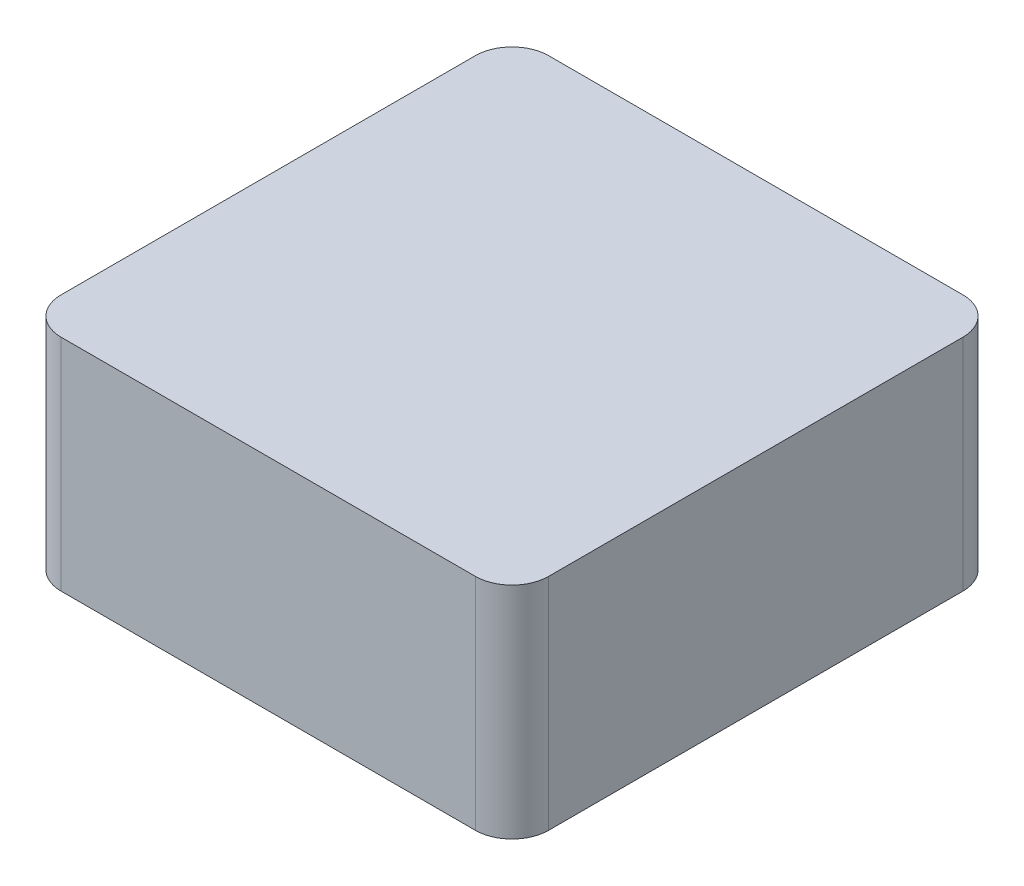
ISO-10303-21;
HEADER;
FILE_DESCRIPTION(('STEP AP214'),'2;1');
FILE_NAME('part.step','',(''),(''),'','','');
FILE_SCHEMA(('AUTOMOTIVE_DESIGN { 1 0 10303 214 1 1 1 1 }'));
ENDSEC;
DATA;
#1=APPLICATION_CONTEXT('core data for automotive mechanical design processes');
#2=APPLICATION_PROTOCOL_DEFINITION('international standard','automotive_design',2000,#1);
#3=PRODUCT_CONTEXT('',#1,'mechanical');
#4=PRODUCT('Part','Part','',(#3));
#5=PRODUCT_RELATED_PRODUCT_CATEGORY('part','',(#4));
#6=PRODUCT_DEFINITION_FORMATION('','',#4);
#7=PRODUCT_DEFINITION_CONTEXT('part definition',#1,'design');
#8=PRODUCT_DEFINITION('design','',#6,#7);
#9=PRODUCT_DEFINITION_SHAPE('','',#8);
#10=(LENGTH_UNIT() NAMED_UNIT(*) SI_UNIT(.MILLI.,.METRE.));
#11=(NAMED_UNIT(*) PLANE_ANGLE_UNIT() SI_UNIT($,.RADIAN.));
#12=(NAMED_UNIT(*) SI_UNIT($,.STERADIAN.) SOLID_ANGLE_UNIT());
#13=UNCERTAINTY_MEASURE_WITH_UNIT(LENGTH_MEASURE(1.E-05),#10,'distance_accuracy_value','');
#14=(GEOMETRIC_REPRESENTATION_CONTEXT(3) GLOBAL_UNCERTAINTY_ASSIGNED_CONTEXT((#13)) GLOBAL_UNIT_ASSIGNED_CONTEXT((#10,
#11,#12)) REPRESENTATION_CONTEXT('',''));
#15=CARTESIAN_POINT('',(0.,0.,0.));
#16=DIRECTION('',(0.,0.,1.));
#17=DIRECTION('',(1.,0.,0.));
#18=AXIS2_PLACEMENT_3D('',#15,#16,#17);
#19=CARTESIAN_POINT('',(3.325,3.,3.325));
#20=DIRECTION('',(-1.,0.,0.));
#21=DIRECTION('',(0.,0.,1.));
#22=AXIS2_PLACEMENT_3D('',#19,#20,#21);
#23=PLANE('',#22);
#24=DIRECTION('',(0.,0.,-1.));
#25=VECTOR('',#24,1.);
#26=CARTESIAN_POINT('',(3.325,0.,3.325));
#27=LINE('',#26,#25);
#28=CARTESIAN_POINT('',(3.325,0.,2.825));
#29=VERTEX_POINT('',#28);
#30=CARTESIAN_POINT('',(3.325,0.,-2.825));
#31=VERTEX_POINT('',#30);
#32=EDGE_CURVE('E138',#29,#31,#27,.T.);
#33=ORIENTED_EDGE('',*,*,#32,.T.);
#34=DIRECTION('',(0.,-1.,0.));
#35=VECTOR('',#34,1.);
#36=CARTESIAN_POINT('',(3.325,3.,-2.825));
#37=LINE('',#36,#35);
#38=CARTESIAN_POINT('',(3.325,3.,-2.825));
#39=VERTEX_POINT('',#38);
#40=EDGE_CURVE('E113',#31,#39,#37,.F.);
#41=ORIENTED_EDGE('',*,*,#40,.T.);
#42=DIRECTION('',(0.,0.,-1.));
#43=VECTOR('',#42,1.);
#44=CARTESIAN_POINT('',(3.325,3.,3.325));
#45=LINE('',#44,#43);
#46=CARTESIAN_POINT('',(3.325,3.,2.825));
#47=VERTEX_POINT('',#46);
#48=EDGE_CURVE('E150',#47,#39,#45,.T.);
#49=ORIENTED_EDGE('',*,*,#48,.F.);
#50=DIRECTION('',(0.,-1.,0.));
#51=VECTOR('',#50,1.);
#52=CARTESIAN_POINT('',(3.325,3.,2.825));
#53=LINE('',#52,#51);
#54=EDGE_CURVE('E119',#47,#29,#53,.T.);
#55=ORIENTED_EDGE('',*,*,#54,.T.);
#56=EDGE_LOOP('',(#33,#41,#49,#55));
#57=FACE_BOUND('',#56,.T.);
#58=ADVANCED_FACE('F41',(#57),#23,.F.);
#59=CARTESIAN_POINT('',(-3.325,3.,-3.325));
#60=DIRECTION('',(0.,0.,1.));
#61=DIRECTION('',(1.,0.,0.));
#62=AXIS2_PLACEMENT_3D('',#59,#60,#61);
#63=PLANE('',#62);
#64=DIRECTION('',(-1.,0.,0.));
#65=VECTOR('',#64,1.);
#66=CARTESIAN_POINT('',(-3.325,3.,-3.325));
#67=LINE('',#66,#65);
#68=CARTESIAN_POINT('',(2.825,3.,-3.325));
#69=VERTEX_POINT('',#68);
#70=CARTESIAN_POINT('',(-2.825,3.,-3.325));
#71=VERTEX_POINT('',#70);
#72=EDGE_CURVE('E129',#69,#71,#67,.T.);
#73=ORIENTED_EDGE('',*,*,#72,.F.);
#74=DIRECTION('',(0.,-1.,0.));
#75=VECTOR('',#74,1.);
#76=CARTESIAN_POINT('',(2.825,3.,-3.325));
#77=LINE('',#76,#75);
#78=CARTESIAN_POINT('',(2.825,0.,-3.325));
#79=VERTEX_POINT('',#78);
#80=EDGE_CURVE('E112',#69,#79,#77,.T.);
#81=ORIENTED_EDGE('',*,*,#80,.T.);
#82=DIRECTION('',(-1.,0.,0.));
#83=VECTOR('',#82,1.);
#84=CARTESIAN_POINT('',(-3.325,0.,-3.325));
#85=LINE('',#84,#83);
#86=CARTESIAN_POINT('',(-2.825,0.,-3.325));
#87=VERTEX_POINT('',#86);
#88=EDGE_CURVE('E126',#79,#87,#85,.T.);
#89=ORIENTED_EDGE('',*,*,#88,.T.);
#90=DIRECTION('',(0.,-1.,0.));
#91=VECTOR('',#90,1.);
#92=CARTESIAN_POINT('',(-2.825,3.,-3.325));
#93=LINE('',#92,#91);
#94=EDGE_CURVE('E132',#87,#71,#93,.F.);
#95=ORIENTED_EDGE('',*,*,#94,.T.);
#96=EDGE_LOOP('',(#73,#81,#89,#95));
#97=FACE_BOUND('',#96,.T.);
#98=ADVANCED_FACE('F125',(#97),#63,.F.);
#99=CARTESIAN_POINT('',(-3.325,3.,3.325));
#100=DIRECTION('',(1.,0.,0.));
#101=DIRECTION('',(0.,0.,-1.));
#102=AXIS2_PLACEMENT_3D('',#99,#100,#101);
#103=PLANE('',#102);
#104=DIRECTION('',(0.,0.,1.));
#105=VECTOR('',#104,1.);
#106=CARTESIAN_POINT('',(-3.325,3.,3.325));
#107=LINE('',#106,#105);
#108=CARTESIAN_POINT('',(-3.325,3.,-2.825));
#109=VERTEX_POINT('',#108);
#110=CARTESIAN_POINT('',(-3.325,3.,2.825));
#111=VERTEX_POINT('',#110);
#112=EDGE_CURVE('E186',#109,#111,#107,.T.);
#113=ORIENTED_EDGE('',*,*,#112,.F.);
#114=DIRECTION('',(0.,-1.,0.));
#115=VECTOR('',#114,1.);
#116=CARTESIAN_POINT('',(-3.325,3.,-2.825));
#117=LINE('',#116,#115);
#118=CARTESIAN_POINT('',(-3.325,0.,-2.825));
#119=VERTEX_POINT('',#118);
#120=EDGE_CURVE('E180',#109,#119,#117,.T.);
#121=ORIENTED_EDGE('',*,*,#120,.T.);
#122=DIRECTION('',(0.,0.,1.));
#123=VECTOR('',#122,1.);
#124=CARTESIAN_POINT('',(-3.325,0.,3.325));
#125=LINE('',#124,#123);
#126=CARTESIAN_POINT('',(-3.325,0.,2.825));
#127=VERTEX_POINT('',#126);
#128=EDGE_CURVE('E137',#119,#127,#125,.T.);
#129=ORIENTED_EDGE('',*,*,#128,.T.);
#130=DIRECTION('',(0.,-1.,0.));
#131=VECTOR('',#130,1.);
#132=CARTESIAN_POINT('',(-3.325,3.,2.825));
#133=LINE('',#132,#131);
#134=EDGE_CURVE('E177',#127,#111,#133,.F.);
#135=ORIENTED_EDGE('',*,*,#134,.T.);
#136=EDGE_LOOP('',(#113,#121,#129,#135));
#137=FACE_BOUND('',#136,.T.);
#138=ADVANCED_FACE('F207',(#137),#103,.F.);
#139=CARTESIAN_POINT('',(-3.325,3.,3.325));
#140=DIRECTION('',(0.,0.,-1.));
#141=DIRECTION('',(-1.,0.,0.));
#142=AXIS2_PLACEMENT_3D('',#139,#140,#141);
#143=PLANE('',#142);
#144=DIRECTION('',(1.,0.,0.));
#145=VECTOR('',#144,1.);
#146=CARTESIAN_POINT('',(-3.325,3.,3.325));
#147=LINE('',#146,#145);
#148=CARTESIAN_POINT('',(-2.825,3.,3.325));
#149=VERTEX_POINT('',#148);
#150=CARTESIAN_POINT('',(2.825,3.,3.325));
#151=VERTEX_POINT('',#150);
#152=EDGE_CURVE('E152',#149,#151,#147,.T.);
#153=ORIENTED_EDGE('',*,*,#152,.F.);
#154=DIRECTION('',(0.,-1.,0.));
#155=VECTOR('',#154,1.);
#156=CARTESIAN_POINT('',(-2.825,3.,3.325));
#157=LINE('',#156,#155);
#158=CARTESIAN_POINT('',(-2.825,0.,3.325));
#159=VERTEX_POINT('',#158);
#160=EDGE_CURVE('E11',#149,#159,#157,.T.);
#161=ORIENTED_EDGE('',*,*,#160,.T.);
#162=DIRECTION('',(1.,0.,0.));
#163=VECTOR('',#162,1.);
#164=CARTESIAN_POINT('',(-3.325,0.,3.325));
#165=LINE('',#164,#163);
#166=CARTESIAN_POINT('',(2.825,0.,3.325));
#167=VERTEX_POINT('',#166);
#168=EDGE_CURVE('E143',#159,#167,#165,.T.);
#169=ORIENTED_EDGE('',*,*,#168,.T.);
#170=DIRECTION('',(0.,-1.,0.));
#171=VECTOR('',#170,1.);
#172=CARTESIAN_POINT('',(2.825,3.,3.325));
#173=LINE('',#172,#171);
#174=EDGE_CURVE('E50',#167,#151,#173,.F.);
#175=ORIENTED_EDGE('',*,*,#174,.T.);
#176=EDGE_LOOP('',(#153,#161,#169,#175));
#177=FACE_BOUND('',#176,.T.);
#178=ADVANCED_FACE('F200',(#177),#143,.F.);
#179=CARTESIAN_POINT('',(0.,3.,0.));
#180=DIRECTION('',(0.,-1.,0.));
#181=DIRECTION('',(0.,0.,-1.));
#182=AXIS2_PLACEMENT_3D('',#179,#180,#181);
#183=PLANE('',#182);
#184=ORIENTED_EDGE('',*,*,#48,.T.);
#185=CARTESIAN_POINT('',(2.825,3.,-2.825));
#186=DIRECTION('',(0.,-1.,0.));
#187=DIRECTION('',(0.,0.,-1.));
#188=AXIS2_PLACEMENT_3D('',#185,#186,#187);
#189=CIRCLE('',#188,0.5);
#190=EDGE_CURVE('E174',#39,#69,#189,.F.);
#191=ORIENTED_EDGE('',*,*,#190,.T.);
#192=ORIENTED_EDGE('',*,*,#72,.T.);
#193=CARTESIAN_POINT('',(-2.825,3.,-2.825));
#194=DIRECTION('',(0.,-1.,0.));
#195=DIRECTION('',(0.,0.,-1.));
#196=AXIS2_PLACEMENT_3D('',#193,#194,#195);
#197=CIRCLE('',#196,0.5);
#198=EDGE_CURVE('E171',#71,#109,#197,.F.);
#199=ORIENTED_EDGE('',*,*,#198,.T.);
#200=ORIENTED_EDGE('',*,*,#112,.T.);
#201=CARTESIAN_POINT('',(-2.825,3.,2.825));
#202=DIRECTION('',(0.,-1.,0.));
#203=DIRECTION('',(0.,0.,-1.));
#204=AXIS2_PLACEMENT_3D('',#201,#202,#203);
#205=CIRCLE('',#204,0.5);
#206=EDGE_CURVE('E63',#111,#149,#205,.F.);
#207=ORIENTED_EDGE('',*,*,#206,.T.);
#208=ORIENTED_EDGE('',*,*,#152,.T.);
#209=CARTESIAN_POINT('',(2.825,3.,2.825));
#210=DIRECTION('',(0.,-1.,0.));
#211=DIRECTION('',(0.,0.,-1.));
#212=AXIS2_PLACEMENT_3D('',#209,#210,#211);
#213=CIRCLE('',#212,0.5);
#214=EDGE_CURVE('E166',#151,#47,#213,.F.);
#215=ORIENTED_EDGE('',*,*,#214,.T.);
#216=EDGE_LOOP('',(#184,#191,#192,#199,#200,#207,#208,#215));
#217=FACE_BOUND('',#216,.T.);
#218=ADVANCED_FACE('F194',(#217),#183,.F.);
#219=CARTESIAN_POINT('',(0.,0.,0.));
#220=DIRECTION('',(0.,-1.,0.));
#221=DIRECTION('',(0.,0.,-1.));
#222=AXIS2_PLACEMENT_3D('',#219,#220,#221);
#223=PLANE('',#222);
#224=ORIENTED_EDGE('',*,*,#88,.F.);
#225=CARTESIAN_POINT('',(2.825,0.,-2.825));
#226=DIRECTION('',(0.,-1.,0.));
#227=DIRECTION('',(0.,0.,-1.));
#228=AXIS2_PLACEMENT_3D('',#225,#226,#227);
#229=CIRCLE('',#228,0.5);
#230=EDGE_CURVE('E108',#79,#31,#229,.T.);
#231=ORIENTED_EDGE('',*,*,#230,.T.);
#232=ORIENTED_EDGE('',*,*,#32,.F.);
#233=CARTESIAN_POINT('',(2.825,0.,2.825));
#234=DIRECTION('',(0.,-1.,0.));
#235=DIRECTION('',(0.,0.,-1.));
#236=AXIS2_PLACEMENT_3D('',#233,#234,#235);
#237=CIRCLE('',#236,0.5);
#238=EDGE_CURVE('E131',#29,#167,#237,.T.);
#239=ORIENTED_EDGE('',*,*,#238,.T.);
#240=ORIENTED_EDGE('',*,*,#168,.F.);
#241=CARTESIAN_POINT('',(-2.825,0.,2.825));
#242=DIRECTION('',(0.,-1.,0.));
#243=DIRECTION('',(0.,0.,-1.));
#244=AXIS2_PLACEMENT_3D('',#241,#242,#243);
#245=CIRCLE('',#244,0.5);
#246=EDGE_CURVE('E156',#159,#127,#245,.T.);
#247=ORIENTED_EDGE('',*,*,#246,.T.);
#248=ORIENTED_EDGE('',*,*,#128,.F.);
#249=CARTESIAN_POINT('',(-2.825,0.,-2.825));
#250=DIRECTION('',(0.,-1.,0.));
#251=DIRECTION('',(0.,0.,-1.));
#252=AXIS2_PLACEMENT_3D('',#249,#250,#251);
#253=CIRCLE('',#252,0.5);
#254=EDGE_CURVE('E120',#119,#87,#253,.T.);
#255=ORIENTED_EDGE('',*,*,#254,.T.);
#256=EDGE_LOOP('',(#224,#231,#232,#239,#240,#247,#248,#255));
#257=FACE_BOUND('',#256,.T.);
#258=ADVANCED_FACE('F134',(#257),#223,.T.);
#259=CARTESIAN_POINT('',(2.825,3.,-2.825));
#260=DIRECTION('',(0.,-1.,0.));
#261=DIRECTION('',(0.,0.,-1.));
#262=AXIS2_PLACEMENT_3D('',#259,#260,#261);
#263=CYLINDRICAL_SURFACE('',#262,0.5);
#264=ORIENTED_EDGE('',*,*,#190,.F.);
#265=ORIENTED_EDGE('',*,*,#40,.F.);
#266=ORIENTED_EDGE('',*,*,#230,.F.);
#267=ORIENTED_EDGE('',*,*,#80,.F.);
#268=EDGE_LOOP('',(#264,#265,#266,#267));
#269=FACE_BOUND('',#268,.T.);
#270=ADVANCED_FACE('F111',(#269),#263,.T.);
#271=CARTESIAN_POINT('',(-2.825,3.,-2.825));
#272=DIRECTION('',(0.,-1.,0.));
#273=DIRECTION('',(0.,0.,-1.));
#274=AXIS2_PLACEMENT_3D('',#271,#272,#273);
#275=CYLINDRICAL_SURFACE('',#274,0.5);
#276=ORIENTED_EDGE('',*,*,#198,.F.);
#277=ORIENTED_EDGE('',*,*,#94,.F.);
#278=ORIENTED_EDGE('',*,*,#254,.F.);
#279=ORIENTED_EDGE('',*,*,#120,.F.);
#280=EDGE_LOOP('',(#276,#277,#278,#279));
#281=FACE_BOUND('',#280,.T.);
#282=ADVANCED_FACE('F211',(#281),#275,.T.);
#283=CARTESIAN_POINT('',(-2.825,3.,2.825));
#284=DIRECTION('',(0.,-1.,0.));
#285=DIRECTION('',(0.,0.,-1.));
#286=AXIS2_PLACEMENT_3D('',#283,#284,#285);
#287=CYLINDRICAL_SURFACE('',#286,0.5);
#288=ORIENTED_EDGE('',*,*,#206,.F.);
#289=ORIENTED_EDGE('',*,*,#134,.F.);
#290=ORIENTED_EDGE('',*,*,#246,.F.);
#291=ORIENTED_EDGE('',*,*,#160,.F.);
#292=EDGE_LOOP('',(#288,#289,#290,#291));
#293=FACE_BOUND('',#292,.T.);
#294=ADVANCED_FACE('F203',(#293),#287,.T.);
#295=CARTESIAN_POINT('',(2.825,3.,2.825));
#296=DIRECTION('',(0.,-1.,0.));
#297=DIRECTION('',(0.,0.,-1.));
#298=AXIS2_PLACEMENT_3D('',#295,#296,#297);
#299=CYLINDRICAL_SURFACE('',#298,0.5);
#300=ORIENTED_EDGE('',*,*,#214,.F.);
#301=ORIENTED_EDGE('',*,*,#174,.F.);
#302=ORIENTED_EDGE('',*,*,#238,.F.);
#303=ORIENTED_EDGE('',*,*,#54,.F.);
#304=EDGE_LOOP('',(#300,#301,#302,#303));
#305=FACE_BOUND('',#304,.T.);
#306=ADVANCED_FACE('F43',(#305),#299,.T.);
#307=CLOSED_SHELL('',(#58,#98,#138,#178,#218,#258,#270,#282,#294,#306));
#308=MANIFOLD_SOLID_BREP('B2',#307);
#309=ADVANCED_BREP_SHAPE_REPRESENTATION('',(#18,#308),#14);
#310=SHAPE_DEFINITION_REPRESENTATION(#9,#309);
ENDSEC;
END-ISO-10303-21;
